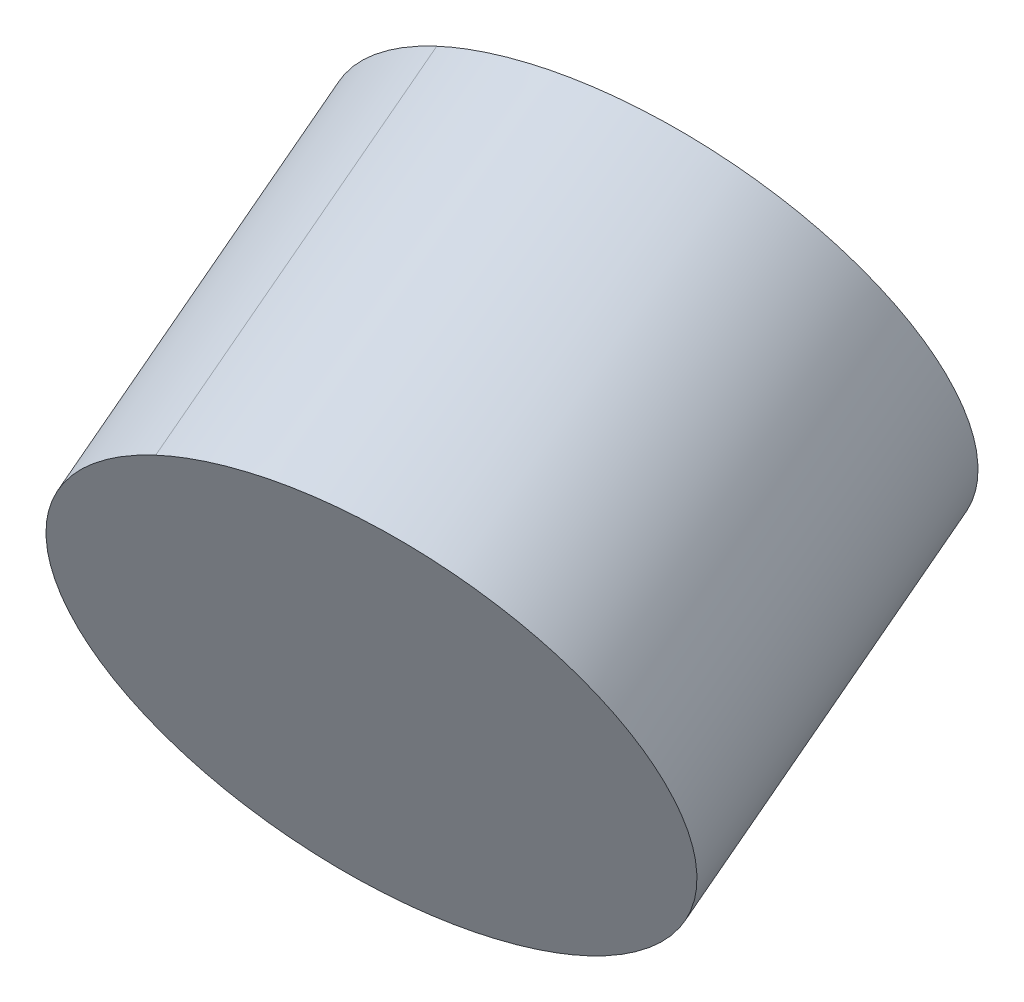
ISO-10303-21;
HEADER;
FILE_DESCRIPTION(('STEP AP214'),'2;1');
FILE_NAME('part.step','',(''),(''),'','','');
FILE_SCHEMA(('AUTOMOTIVE_DESIGN { 1 0 10303 214 1 1 1 1 }'));
ENDSEC;
DATA;
#1=APPLICATION_CONTEXT('core data for automotive mechanical design processes');
#2=APPLICATION_PROTOCOL_DEFINITION('international standard','automotive_design',2000,#1);
#3=PRODUCT_CONTEXT('',#1,'mechanical');
#4=PRODUCT('Part','Part','',(#3));
#5=PRODUCT_RELATED_PRODUCT_CATEGORY('part','',(#4));
#6=PRODUCT_DEFINITION_FORMATION('','',#4);
#7=PRODUCT_DEFINITION_CONTEXT('part definition',#1,'design');
#8=PRODUCT_DEFINITION('design','',#6,#7);
#9=PRODUCT_DEFINITION_SHAPE('','',#8);
#10=(LENGTH_UNIT() NAMED_UNIT(*) SI_UNIT(.MILLI.,.METRE.));
#11=(NAMED_UNIT(*) PLANE_ANGLE_UNIT() SI_UNIT($,.RADIAN.));
#12=(NAMED_UNIT(*) SI_UNIT($,.STERADIAN.) SOLID_ANGLE_UNIT());
#13=UNCERTAINTY_MEASURE_WITH_UNIT(LENGTH_MEASURE(1.E-05),#10,'distance_accuracy_value','');
#14=(GEOMETRIC_REPRESENTATION_CONTEXT(3) GLOBAL_UNCERTAINTY_ASSIGNED_CONTEXT((#13)) GLOBAL_UNIT_ASSIGNED_CONTEXT((#10,
#11,#12)) REPRESENTATION_CONTEXT('',''));
#15=CARTESIAN_POINT('',(0.,0.,0.));
#16=DIRECTION('',(0.,0.,1.));
#17=DIRECTION('',(1.,0.,0.));
#18=AXIS2_PLACEMENT_3D('',#15,#16,#17);
#19=CARTESIAN_POINT('',(261.621528790794,101.358293706028,-84.9045513463891));
#20=CARTESIAN_POINT('',(262.037247634597,101.551092265286,-84.9049914770501));
#21=CARTESIAN_POINT('',(262.633626873346,101.897815144166,-84.876342995473));
#22=CARTESIAN_POINT('',(263.35428716223,102.457842121611,-84.7828426563687));
#23=CARTESIAN_POINT('',(264.018807369555,103.077075204438,-84.6536981481719));
#24=CARTESIAN_POINT('',(264.73012668083,103.952781246497,-84.4265979755462));
#25=CARTESIAN_POINT('',(265.362101929108,105.12494517503,-84.0602949861909));
#26=CARTESIAN_POINT('',(265.745443573961,106.37422070243,-83.6134019304533));
#27=CARTESIAN_POINT('',(265.868909506934,107.651986405807,-83.1040276061363));
#28=CARTESIAN_POINT('',(265.748198591627,108.699683257664,-82.6431644955536));
#29=CARTESIAN_POINT('',(265.522095070384,109.503664449511,-82.263525534201));
#30=CARTESIAN_POINT('',(265.288999903861,110.083697210258,-81.9760137417953));
#31=CARTESIAN_POINT('',(264.994499691024,110.635096408166,-81.6885019157816));
#32=CARTESIAN_POINT('',(264.523950930604,111.325090904285,-81.3088629580613));
#33=CARTESIAN_POINT('',(263.798960148946,112.091007320876,-80.8479998916941));
#34=CARTESIAN_POINT('',(262.74077231215,112.817758997953,-80.338625493976));
#35=CARTESIAN_POINT('',(261.53736432186,113.327121155982,-79.8917323810174));
#36=CARTESIAN_POINT('',(260.233208866785,113.596452425479,-79.5254294270933));
#37=CARTESIAN_POINT('',(259.105151894449,113.614443195124,-79.2983292649614));
#38=CARTESIAN_POINT('',(258.203646482854,113.503426530973,-79.169184760107));
#39=CARTESIAN_POINT('',(257.311409423999,113.311347114801,-79.0756844245717));
#40=CARTESIAN_POINT('',(256.662459126889,113.077363288087,-79.0470359455398));
#41=CARTESIAN_POINT('',(256.247547989095,112.882832725958,-79.0474760761487));
#42=B_SPLINE_CURVE_WITH_KNOTS('',3,(#19,#20,#21,#22,#23,#24,#25,#26,#27,#28,#29,#30,#31,#32,#33,
#34,#35,#36,#37,#38,#39,#40,#41),.UNSPECIFIED.,.F.,.F.,(4,1,1,1,1,1,1,1,1,1,1,1,1,1,1,1,1,1,1,1,
4),(0.,0.0625,0.09375,0.125,0.1875,0.25,0.3125,0.375,0.4375,0.46875,0.5,0.53125,0.5625,0.625,
0.6875,0.75,0.8125,0.875,0.90625,0.9375,1.),.UNSPECIFIED.);
#43=DIRECTION('',(-0.17680764068516,0.379165209048293,-0.908280134343315));
#44=VECTOR('',#43,1.);
#45=SURFACE_OF_LINEAR_EXTRUSION('',#42,#44);
#46=CARTESIAN_POINT('',(259.853452383943,105.149945796511,-93.9873526898223));
#47=CARTESIAN_POINT('',(260.269171227746,105.342744355769,-93.9877928204833));
#48=CARTESIAN_POINT('',(260.865550466494,105.689467234649,-93.9591443389061));
#49=CARTESIAN_POINT('',(261.586210755378,106.249494212094,-93.8656439998019));
#50=CARTESIAN_POINT('',(262.250730962703,106.868727294921,-93.736499491605));
#51=CARTESIAN_POINT('',(262.962050273978,107.74443333698,-93.5093993189794));
#52=CARTESIAN_POINT('',(263.594025522256,108.916597265513,-93.143096329624));
#53=CARTESIAN_POINT('',(263.977367167109,110.165872792913,-92.6962032738865));
#54=CARTESIAN_POINT('',(264.100833100082,111.44363849629,-92.1868289495695));
#55=CARTESIAN_POINT('',(263.980122184775,112.491335348147,-91.7259658389867));
#56=CARTESIAN_POINT('',(263.754018663532,113.295316539994,-91.3463268776342));
#57=CARTESIAN_POINT('',(263.520923497009,113.875349300741,-91.0588150852284));
#58=CARTESIAN_POINT('',(263.226423284172,114.426748498649,-90.7713032592147));
#59=CARTESIAN_POINT('',(262.755874523753,115.116742994768,-90.3916643014945));
#60=CARTESIAN_POINT('',(262.030883742094,115.882659411359,-89.9308012351273));
#61=CARTESIAN_POINT('',(260.972695905298,116.609411088436,-89.4214268374092));
#62=CARTESIAN_POINT('',(259.769287915009,117.118773246465,-88.9745337244506));
#63=CARTESIAN_POINT('',(258.465132459934,117.388104515962,-88.6082307705265));
#64=CARTESIAN_POINT('',(257.337075487598,117.406095285607,-88.3811306083946));
#65=CARTESIAN_POINT('',(256.435570076002,117.295078621456,-88.2519861035402));
#66=CARTESIAN_POINT('',(255.543333017147,117.102999205284,-88.1584857680049));
#67=CARTESIAN_POINT('',(254.894382720037,116.86901537857,-88.1298372889729));
#68=CARTESIAN_POINT('',(254.479471582243,116.674484816441,-88.1302774195819));
#69=B_SPLINE_CURVE_WITH_KNOTS('',3,(#46,#47,#48,#49,#50,#51,#52,#53,#54,#55,#56,#57,#58,#59,#60,
#61,#62,#63,#64,#65,#66,#67,#68),.UNSPECIFIED.,.F.,.F.,(4,1,1,1,1,1,1,1,1,1,1,1,1,1,1,1,1,1,1,1,
4),(0.,0.0625,0.09375,0.125,0.1875,0.25,0.3125,0.375,0.4375,0.46875,0.5,0.53125,0.5625,0.625,
0.6875,0.75,0.8125,0.875,0.90625,0.9375,1.),.UNSPECIFIED.);
#70=CARTESIAN_POINT('',(259.853452383943,105.149945796511,-93.9873526898223));
#71=VERTEX_POINT('',#70);
#72=CARTESIAN_POINT('',(254.479471582243,116.674484816441,-88.1302774195819));
#73=VERTEX_POINT('',#72);
#74=EDGE_CURVE('E46',#71,#73,#69,.T.);
#75=ORIENTED_EDGE('',*,*,#74,.T.);
#76=DIRECTION('',(-0.17680764068516,0.379165209048293,-0.908280134343315));
#77=VECTOR('',#76,1.);
#78=CARTESIAN_POINT('',(256.247547989095,112.882832725958,-79.0474760761487));
#79=LINE('',#78,#77);
#80=CARTESIAN_POINT('',(256.247547989095,112.882832725958,-79.0474760761487));
#81=VERTEX_POINT('',#80);
#82=EDGE_CURVE('E11',#81,#73,#79,.T.);
#83=ORIENTED_EDGE('',*,*,#82,.F.);
#84=CARTESIAN_POINT('',(261.621528790794,101.358293706028,-84.9045513463891));
#85=VERTEX_POINT('',#84);
#86=EDGE_CURVE('E48',#85,#81,#42,.T.);
#87=ORIENTED_EDGE('',*,*,#86,.F.);
#88=DIRECTION('',(-0.17680764068516,0.379165209048293,-0.908280134343315));
#89=VECTOR('',#88,1.);
#90=CARTESIAN_POINT('',(261.621528790794,101.358293706028,-84.9045513463891));
#91=LINE('',#90,#89);
#92=EDGE_CURVE('E21',#71,#85,#91,.F.);
#93=ORIENTED_EDGE('',*,*,#92,.F.);
#94=EDGE_LOOP('',(#75,#83,#87,#93));
#95=FACE_BOUND('',#94,.T.);
#96=ADVANCED_FACE('F17',(#95),#45,.F.);
#97=CARTESIAN_POINT('',(256.247547989095,112.882832725958,-79.0474760761487));
#98=CARTESIAN_POINT('',(255.831829145292,112.6900341667,-79.0470359454877));
#99=CARTESIAN_POINT('',(255.235449906544,112.34331128782,-79.0756844270647));
#100=CARTESIAN_POINT('',(254.514789617659,111.783284310375,-79.1691847661688));
#101=CARTESIAN_POINT('',(253.850269410335,111.164051227548,-79.2983292743658));
#102=CARTESIAN_POINT('',(253.138950099059,110.288345185489,-79.5254294469914));
#103=CARTESIAN_POINT('',(252.506974850781,109.116181256956,-79.8917324363466));
#104=CARTESIAN_POINT('',(252.123633205928,107.866905729556,-80.3386254920843));
#105=CARTESIAN_POINT('',(252.000167272955,106.589140026179,-80.8479998164013));
#106=CARTESIAN_POINT('',(252.120878188263,105.541443174322,-81.3088629269841));
#107=CARTESIAN_POINT('',(252.346981709505,104.737461982475,-81.6885018883366));
#108=CARTESIAN_POINT('',(252.580076876029,104.157429221728,-81.9760136807423));
#109=CARTESIAN_POINT('',(252.874577088866,103.60603002382,-82.2635255067561));
#110=CARTESIAN_POINT('',(253.345125849285,102.916035527701,-82.6431644644763));
#111=CARTESIAN_POINT('',(254.070116630944,102.15011911111,-83.1040275308435));
#112=CARTESIAN_POINT('',(255.128304467739,101.423367434033,-83.6134019285615));
#113=CARTESIAN_POINT('',(256.331712458029,100.914005276005,-84.0602950415201));
#114=CARTESIAN_POINT('',(257.635867913104,100.644674006507,-84.4265979954443));
#115=CARTESIAN_POINT('',(258.763924885439,100.626683236862,-84.6536981575763));
#116=CARTESIAN_POINT('',(259.665430297036,100.737699901013,-84.7828426624305));
#117=CARTESIAN_POINT('',(260.55766735589,100.929779317184,-84.876342997966));
#118=CARTESIAN_POINT('',(261.206617653,101.163763143898,-84.9049914769981));
#119=CARTESIAN_POINT('',(261.621528790794,101.358293706028,-84.9045513463891));
#120=B_SPLINE_CURVE_WITH_KNOTS('',3,(#97,#98,#99,#100,#101,#102,#103,#104,#105,#106,#107,#108,
#109,#110,#111,#112,#113,#114,#115,#116,#117,#118,#119),.UNSPECIFIED.,.F.,.F.,(4,1,1,1,1,1,1,1,
1,1,1,1,1,1,1,1,1,1,1,1,4),(0.,0.0625,0.09375,0.125,0.1875,0.25,0.3125,0.375,0.4375,0.46875,0.5,
0.53125,0.5625,0.625,0.6875,0.75,0.8125,0.875,0.90625,0.9375,1.),.UNSPECIFIED.);
#121=DIRECTION('',(-0.17680764068516,0.379165209048293,-0.908280134343315));
#122=VECTOR('',#121,1.);
#123=SURFACE_OF_LINEAR_EXTRUSION('',#120,#122);
#124=CARTESIAN_POINT('',(254.479471582243,116.674484816441,-88.1302774195819));
#125=CARTESIAN_POINT('',(254.06375273844,116.481686257183,-88.1298372889209));
#126=CARTESIAN_POINT('',(253.467373499692,116.134963378303,-88.1584857704978));
#127=CARTESIAN_POINT('',(252.746713210808,115.574936400858,-88.251986109602));
#128=CARTESIAN_POINT('',(252.082193003483,114.955703318031,-88.3811306177989));
#129=CARTESIAN_POINT('',(251.370873692208,114.079997275972,-88.6082307904246));
#130=CARTESIAN_POINT('',(250.73889844393,112.907833347439,-88.9745337797798));
#131=CARTESIAN_POINT('',(250.355556799077,111.658557820039,-89.4214268355174));
#132=CARTESIAN_POINT('',(250.232090866104,110.380792116662,-89.9308011598344));
#133=CARTESIAN_POINT('',(250.352801781411,109.333095264805,-90.3916642704172));
#134=CARTESIAN_POINT('',(250.578905302654,108.529114072958,-90.7713032317698));
#135=CARTESIAN_POINT('',(250.812000469177,107.949081312211,-91.0588150241755));
#136=CARTESIAN_POINT('',(251.106500682015,107.397682114303,-91.3463268501892));
#137=CARTESIAN_POINT('',(251.577049442433,106.707687618184,-91.7259658079095));
#138=CARTESIAN_POINT('',(252.302040224092,105.941771201593,-92.1868288742766));
#139=CARTESIAN_POINT('',(253.360228060888,105.215019524516,-92.6962032719947));
#140=CARTESIAN_POINT('',(254.563636051178,104.705657366488,-93.1430963849532));
#141=CARTESIAN_POINT('',(255.867791506253,104.43632609699,-93.5093993388775));
#142=CARTESIAN_POINT('',(256.995848478588,104.418335327345,-93.7364995010094));
#143=CARTESIAN_POINT('',(257.897353890184,104.529351991496,-93.8656440058637));
#144=CARTESIAN_POINT('',(258.789590949039,104.721431407667,-93.9591443413991));
#145=CARTESIAN_POINT('',(259.438541246149,104.955415234381,-93.9877928204312));
#146=CARTESIAN_POINT('',(259.853452383943,105.149945796511,-93.9873526898223));
#147=B_SPLINE_CURVE_WITH_KNOTS('',3,(#124,#125,#126,#127,#128,#129,#130,#131,#132,#133,#134,
#135,#136,#137,#138,#139,#140,#141,#142,#143,#144,#145,#146),.UNSPECIFIED.,.F.,.F.,(4,1,1,1,1,1,
1,1,1,1,1,1,1,1,1,1,1,1,1,1,4),(0.,0.0625,0.09375,0.125,0.1875,0.25,0.3125,0.375,0.4375,0.46875,
0.5,0.53125,0.5625,0.625,0.6875,0.75,0.8125,0.875,0.90625,0.9375,1.),.UNSPECIFIED.);
#148=EDGE_CURVE('E40',#73,#71,#147,.T.);
#149=ORIENTED_EDGE('',*,*,#148,.T.);
#150=ORIENTED_EDGE('',*,*,#92,.T.);
#151=EDGE_CURVE('E34',#81,#85,#120,.T.);
#152=ORIENTED_EDGE('',*,*,#151,.F.);
#153=ORIENTED_EDGE('',*,*,#82,.T.);
#154=EDGE_LOOP('',(#149,#150,#152,#153));
#155=FACE_BOUND('',#154,.T.);
#156=ADVANCED_FACE('F51',(#155),#123,.F.);
#157=CARTESIAN_POINT('',(265.278765729475,110.078924949785,-81.976013736194));
#158=DIRECTION('',(-0.176807640685103,0.379165209048191,-0.90828013434337));
#159=DIRECTION('',(0.,0.922818750832539,0.385234413197825));
#160=AXIS2_PLACEMENT_3D('',#157,#158,#159);
#161=PLANE('',#160);
#162=ORIENTED_EDGE('',*,*,#86,.T.);
#163=ORIENTED_EDGE('',*,*,#151,.T.);
#164=EDGE_LOOP('',(#162,#163));
#165=FACE_BOUND('',#164,.T.);
#166=ADVANCED_FACE('F83',(#165),#161,.F.);
#167=CARTESIAN_POINT('',(263.510689322623,113.870577040268,-91.0588150796271));
#168=DIRECTION('',(-0.176807640685103,0.379165209048191,-0.90828013434337));
#169=DIRECTION('',(0.,0.922818750832539,0.385234413197825));
#170=AXIS2_PLACEMENT_3D('',#167,#168,#169);
#171=PLANE('',#170);
#172=ORIENTED_EDGE('',*,*,#74,.F.);
#173=ORIENTED_EDGE('',*,*,#148,.F.);
#174=EDGE_LOOP('',(#172,#173));
#175=FACE_BOUND('',#174,.T.);
#176=ADVANCED_FACE('F44',(#175),#171,.T.);
#177=CLOSED_SHELL('',(#96,#156,#166,#176));
#178=MANIFOLD_SOLID_BREP('B1',#177);
#179=ADVANCED_BREP_SHAPE_REPRESENTATION('',(#18,#178),#14);
#180=SHAPE_DEFINITION_REPRESENTATION(#9,#179);
ENDSEC;
END-ISO-10303-21;
